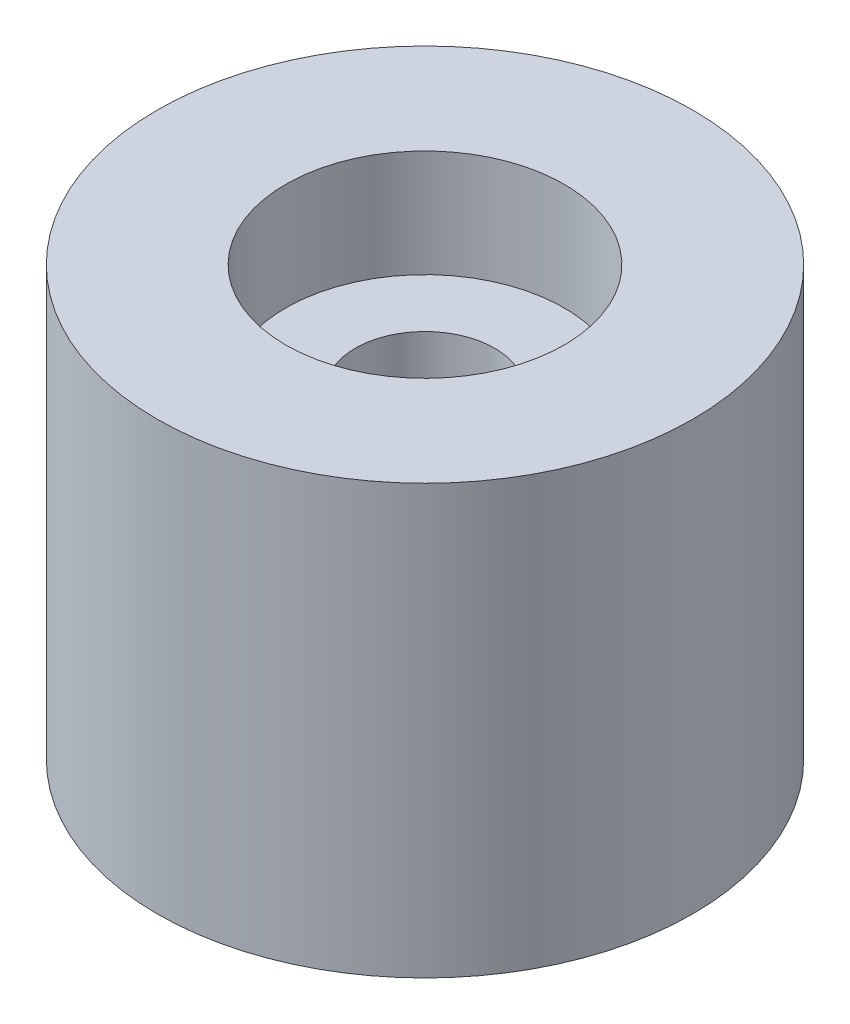
ISO-10303-21;
HEADER;
FILE_DESCRIPTION(('STEP AP214'),'2;1');
FILE_NAME('part.step','',(''),(''),'','','');
FILE_SCHEMA(('AUTOMOTIVE_DESIGN { 1 0 10303 214 1 1 1 1 }'));
ENDSEC;
DATA;
#1=APPLICATION_CONTEXT('core data for automotive mechanical design processes');
#2=APPLICATION_PROTOCOL_DEFINITION('international standard','automotive_design',2000,#1);
#3=PRODUCT_CONTEXT('',#1,'mechanical');
#4=PRODUCT('Part','Part','',(#3));
#5=PRODUCT_RELATED_PRODUCT_CATEGORY('part','',(#4));
#6=PRODUCT_DEFINITION_FORMATION('','',#4);
#7=PRODUCT_DEFINITION_CONTEXT('part definition',#1,'design');
#8=PRODUCT_DEFINITION('design','',#6,#7);
#9=PRODUCT_DEFINITION_SHAPE('','',#8);
#10=(LENGTH_UNIT() NAMED_UNIT(*) SI_UNIT(.MILLI.,.METRE.));
#11=(NAMED_UNIT(*) PLANE_ANGLE_UNIT() SI_UNIT($,.RADIAN.));
#12=(NAMED_UNIT(*) SI_UNIT($,.STERADIAN.) SOLID_ANGLE_UNIT());
#13=UNCERTAINTY_MEASURE_WITH_UNIT(LENGTH_MEASURE(1.E-05),#10,'distance_accuracy_value','');
#14=(GEOMETRIC_REPRESENTATION_CONTEXT(3) GLOBAL_UNCERTAINTY_ASSIGNED_CONTEXT((#13)) GLOBAL_UNIT_ASSIGNED_CONTEXT((#10,
#11,#12)) REPRESENTATION_CONTEXT('',''));
#15=CARTESIAN_POINT('',(0.,0.,0.));
#16=DIRECTION('',(0.,0.,1.));
#17=DIRECTION('',(1.,0.,0.));
#18=AXIS2_PLACEMENT_3D('',#15,#16,#17);
#19=CARTESIAN_POINT('',(0.,20.,0.));
#20=DIRECTION('',(0.,-1.,0.));
#21=DIRECTION('',(0.,0.,-1.));
#22=AXIS2_PLACEMENT_3D('',#19,#20,#21);
#23=CYLINDRICAL_SURFACE('',#22,3.25);
#24=CARTESIAN_POINT('',(0.,4.99999999999999,0.));
#25=DIRECTION('',(0.,1.,0.));
#26=DIRECTION('',(0.,0.,1.));
#27=AXIS2_PLACEMENT_3D('',#24,#25,#26);
#28=CIRCLE('',#27,3.25);
#29=CARTESIAN_POINT('',(0.,4.99999999999999,3.25));
#30=VERTEX_POINT('',#29);
#31=EDGE_CURVE('E44',#30,#30,#28,.T.);
#32=ORIENTED_EDGE('',*,*,#31,.F.);
#33=EDGE_LOOP('',(#32));
#34=FACE_BOUND('',#33,.T.);
#35=CARTESIAN_POINT('',(0.,15.,0.));
#36=DIRECTION('',(0.,1.,0.));
#37=DIRECTION('',(0.,0.,1.));
#38=AXIS2_PLACEMENT_3D('',#35,#36,#37);
#39=CIRCLE('',#38,3.25);
#40=CARTESIAN_POINT('',(0.,15.,3.25));
#41=VERTEX_POINT('',#40);
#42=EDGE_CURVE('E35',#41,#41,#39,.T.);
#43=ORIENTED_EDGE('',*,*,#42,.T.);
#44=EDGE_LOOP('',(#43));
#45=FACE_BOUND('',#44,.T.);
#46=ADVANCED_FACE('F31',(#34,#45),#23,.F.);
#47=CARTESIAN_POINT('',(0.,20.,0.));
#48=DIRECTION('',(0.,1.,0.));
#49=DIRECTION('',(0.,0.,1.));
#50=AXIS2_PLACEMENT_3D('',#47,#48,#49);
#51=PLANE('',#50);
#52=CARTESIAN_POINT('',(0.,20.,0.));
#53=DIRECTION('',(0.,1.,0.));
#54=DIRECTION('',(0.,0.,1.));
#55=AXIS2_PLACEMENT_3D('',#52,#53,#54);
#56=CIRCLE('',#55,6.5);
#57=CARTESIAN_POINT('',(0.,20.,6.5));
#58=VERTEX_POINT('',#57);
#59=EDGE_CURVE('E58',#58,#58,#56,.T.);
#60=ORIENTED_EDGE('',*,*,#59,.F.);
#61=EDGE_LOOP('',(#60));
#62=FACE_BOUND('',#61,.T.);
#63=CARTESIAN_POINT('',(0.,20.,0.));
#64=DIRECTION('',(0.,1.,0.));
#65=DIRECTION('',(0.,0.,1.));
#66=AXIS2_PLACEMENT_3D('',#63,#64,#65);
#67=CIRCLE('',#66,12.5);
#68=CARTESIAN_POINT('',(0.,20.,12.5));
#69=VERTEX_POINT('',#68);
#70=EDGE_CURVE('E10',#69,#69,#67,.T.);
#71=ORIENTED_EDGE('',*,*,#70,.T.);
#72=EDGE_LOOP('',(#71));
#73=FACE_BOUND('',#72,.T.);
#74=ADVANCED_FACE('F80',(#62,#73),#51,.T.);
#75=CARTESIAN_POINT('',(0.,0.,0.));
#76=DIRECTION('',(0.,1.,0.));
#77=DIRECTION('',(0.,0.,1.));
#78=AXIS2_PLACEMENT_3D('',#75,#76,#77);
#79=PLANE('',#78);
#80=CARTESIAN_POINT('',(0.,0.,0.));
#81=DIRECTION('',(0.,1.,0.));
#82=DIRECTION('',(0.,0.,1.));
#83=AXIS2_PLACEMENT_3D('',#80,#81,#82);
#84=CIRCLE('',#83,6.5);
#85=CARTESIAN_POINT('',(0.,0.,6.5));
#86=VERTEX_POINT('',#85);
#87=EDGE_CURVE('E47',#86,#86,#84,.T.);
#88=ORIENTED_EDGE('',*,*,#87,.T.);
#89=EDGE_LOOP('',(#88));
#90=FACE_BOUND('',#89,.T.);
#91=CARTESIAN_POINT('',(0.,0.,0.));
#92=DIRECTION('',(0.,1.,0.));
#93=DIRECTION('',(0.,0.,1.));
#94=AXIS2_PLACEMENT_3D('',#91,#92,#93);
#95=CIRCLE('',#94,12.5);
#96=CARTESIAN_POINT('',(0.,0.,12.5));
#97=VERTEX_POINT('',#96);
#98=EDGE_CURVE('E39',#97,#97,#95,.T.);
#99=ORIENTED_EDGE('',*,*,#98,.F.);
#100=EDGE_LOOP('',(#99));
#101=FACE_BOUND('',#100,.T.);
#102=ADVANCED_FACE('F86',(#90,#101),#79,.F.);
#103=CARTESIAN_POINT('',(0.,20.,0.));
#104=DIRECTION('',(0.,-1.,0.));
#105=DIRECTION('',(0.,0.,-1.));
#106=AXIS2_PLACEMENT_3D('',#103,#104,#105);
#107=CYLINDRICAL_SURFACE('',#106,12.5);
#108=ORIENTED_EDGE('',*,*,#70,.F.);
#109=EDGE_LOOP('',(#108));
#110=FACE_BOUND('',#109,.T.);
#111=ORIENTED_EDGE('',*,*,#98,.T.);
#112=EDGE_LOOP('',(#111));
#113=FACE_BOUND('',#112,.T.);
#114=ADVANCED_FACE('F33',(#110,#113),#107,.T.);
#115=CARTESIAN_POINT('',(0.,4.99999999999999,0.));
#116=DIRECTION('',(0.,-1.,0.));
#117=DIRECTION('',(0.,0.,-1.));
#118=AXIS2_PLACEMENT_3D('',#115,#116,#117);
#119=CYLINDRICAL_SURFACE('',#118,6.5);
#120=CARTESIAN_POINT('',(0.,4.99999999999999,0.));
#121=DIRECTION('',(0.,1.,0.));
#122=DIRECTION('',(0.,0.,1.));
#123=AXIS2_PLACEMENT_3D('',#120,#121,#122);
#124=CIRCLE('',#123,6.5);
#125=CARTESIAN_POINT('',(0.,4.99999999999999,6.5));
#126=VERTEX_POINT('',#125);
#127=EDGE_CURVE('E50',#126,#126,#124,.T.);
#128=ORIENTED_EDGE('',*,*,#127,.T.);
#129=EDGE_LOOP('',(#128));
#130=FACE_BOUND('',#129,.T.);
#131=ORIENTED_EDGE('',*,*,#87,.F.);
#132=EDGE_LOOP('',(#131));
#133=FACE_BOUND('',#132,.T.);
#134=ADVANCED_FACE('F90',(#130,#133),#119,.F.);
#135=CARTESIAN_POINT('',(0.,4.99999999999999,0.));
#136=DIRECTION('',(0.,1.,0.));
#137=DIRECTION('',(0.,0.,1.));
#138=AXIS2_PLACEMENT_3D('',#135,#136,#137);
#139=PLANE('',#138);
#140=ORIENTED_EDGE('',*,*,#31,.T.);
#141=EDGE_LOOP('',(#140));
#142=FACE_BOUND('',#141,.T.);
#143=ORIENTED_EDGE('',*,*,#127,.F.);
#144=EDGE_LOOP('',(#143));
#145=FACE_BOUND('',#144,.T.);
#146=ADVANCED_FACE('F76',(#142,#145),#139,.F.);
#147=CARTESIAN_POINT('',(0.,15.,0.));
#148=DIRECTION('',(0.,1.,0.));
#149=DIRECTION('',(0.,0.,1.));
#150=AXIS2_PLACEMENT_3D('',#147,#148,#149);
#151=CYLINDRICAL_SURFACE('',#150,6.5);
#152=CARTESIAN_POINT('',(0.,15.,0.));
#153=DIRECTION('',(0.,1.,0.));
#154=DIRECTION('',(0.,0.,1.));
#155=AXIS2_PLACEMENT_3D('',#152,#153,#154);
#156=CIRCLE('',#155,6.5);
#157=CARTESIAN_POINT('',(0.,15.,6.5));
#158=VERTEX_POINT('',#157);
#159=EDGE_CURVE('E61',#158,#158,#156,.T.);
#160=ORIENTED_EDGE('',*,*,#159,.F.);
#161=EDGE_LOOP('',(#160));
#162=FACE_BOUND('',#161,.T.);
#163=ORIENTED_EDGE('',*,*,#59,.T.);
#164=EDGE_LOOP('',(#163));
#165=FACE_BOUND('',#164,.T.);
#166=ADVANCED_FACE('F71',(#162,#165),#151,.F.);
#167=CARTESIAN_POINT('',(0.,15.,0.));
#168=DIRECTION('',(0.,1.,0.));
#169=DIRECTION('',(0.,0.,1.));
#170=AXIS2_PLACEMENT_3D('',#167,#168,#169);
#171=PLANE('',#170);
#172=ORIENTED_EDGE('',*,*,#42,.F.);
#173=EDGE_LOOP('',(#172));
#174=FACE_BOUND('',#173,.T.);
#175=ORIENTED_EDGE('',*,*,#159,.T.);
#176=EDGE_LOOP('',(#175));
#177=FACE_BOUND('',#176,.T.);
#178=ADVANCED_FACE('F69',(#174,#177),#171,.T.);
#179=CLOSED_SHELL('',(#46,#74,#102,#114,#134,#146,#166,#178));
#180=MANIFOLD_SOLID_BREP('B2',#179);
#181=ADVANCED_BREP_SHAPE_REPRESENTATION('',(#18,#180),#14);
#182=SHAPE_DEFINITION_REPRESENTATION(#9,#181);
ENDSEC;
END-ISO-10303-21;
